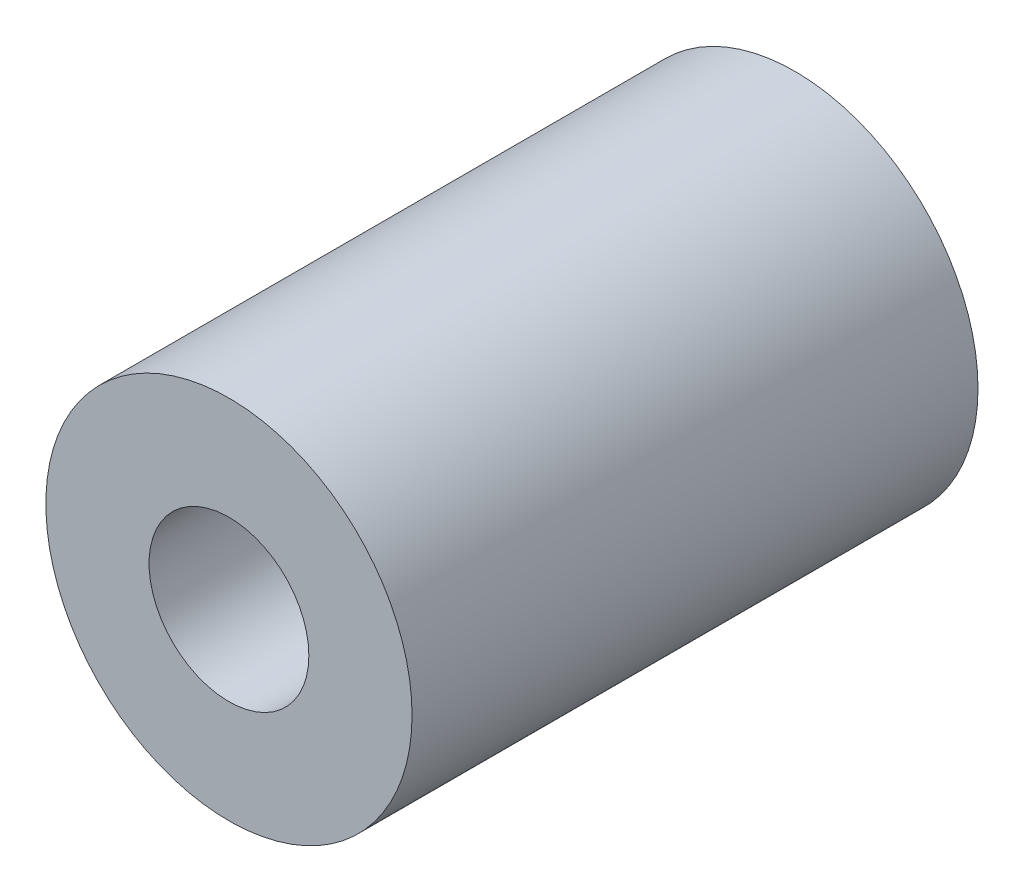
ISO-10303-21;
HEADER;
FILE_DESCRIPTION(('STEP AP214'),'2;1');
FILE_NAME('part.step','',(''),(''),'','','');
FILE_SCHEMA(('AUTOMOTIVE_DESIGN { 1 0 10303 214 1 1 1 1 }'));
ENDSEC;
DATA;
#1=APPLICATION_CONTEXT('core data for automotive mechanical design processes');
#2=APPLICATION_PROTOCOL_DEFINITION('international standard','automotive_design',2000,#1);
#3=PRODUCT_CONTEXT('',#1,'mechanical');
#4=PRODUCT('Part','Part','',(#3));
#5=PRODUCT_RELATED_PRODUCT_CATEGORY('part','',(#4));
#6=PRODUCT_DEFINITION_FORMATION('','',#4);
#7=PRODUCT_DEFINITION_CONTEXT('part definition',#1,'design');
#8=PRODUCT_DEFINITION('design','',#6,#7);
#9=PRODUCT_DEFINITION_SHAPE('','',#8);
#10=(LENGTH_UNIT() NAMED_UNIT(*) SI_UNIT(.MILLI.,.METRE.));
#11=(NAMED_UNIT(*) PLANE_ANGLE_UNIT() SI_UNIT($,.RADIAN.));
#12=(NAMED_UNIT(*) SI_UNIT($,.STERADIAN.) SOLID_ANGLE_UNIT());
#13=UNCERTAINTY_MEASURE_WITH_UNIT(LENGTH_MEASURE(1.E-05),#10,'distance_accuracy_value','');
#14=(GEOMETRIC_REPRESENTATION_CONTEXT(3) GLOBAL_UNCERTAINTY_ASSIGNED_CONTEXT((#13)) GLOBAL_UNIT_ASSIGNED_CONTEXT((#10,
#11,#12)) REPRESENTATION_CONTEXT('',''));
#15=CARTESIAN_POINT('',(0.,0.,0.));
#16=DIRECTION('',(0.,0.,1.));
#17=DIRECTION('',(1.,0.,0.));
#18=AXIS2_PLACEMENT_3D('',#15,#16,#17);
#19=CARTESIAN_POINT('',(0.,0.,85.));
#20=DIRECTION('',(0.,0.,1.));
#21=DIRECTION('',(1.,0.,0.));
#22=AXIS2_PLACEMENT_3D('',#19,#20,#21);
#23=PLANE('',#22);
#24=CARTESIAN_POINT('',(0.,0.,85.));
#25=DIRECTION('',(0.,0.,1.));
#26=DIRECTION('',(1.,0.,0.));
#27=AXIS2_PLACEMENT_3D('',#24,#25,#26);
#28=CIRCLE('',#27,27.5);
#29=CARTESIAN_POINT('',(27.5,0.,85.));
#30=VERTEX_POINT('',#29);
#31=EDGE_CURVE('E10',#30,#30,#28,.T.);
#32=ORIENTED_EDGE('',*,*,#31,.T.);
#33=EDGE_LOOP('',(#32));
#34=FACE_BOUND('',#33,.T.);
#35=CARTESIAN_POINT('',(0.,0.,85.));
#36=DIRECTION('',(0.,0.,1.));
#37=DIRECTION('',(1.,0.,0.));
#38=AXIS2_PLACEMENT_3D('',#35,#36,#37);
#39=CIRCLE('',#38,12.);
#40=CARTESIAN_POINT('',(12.,0.,85.));
#41=VERTEX_POINT('',#40);
#42=EDGE_CURVE('E44',#41,#41,#39,.T.);
#43=ORIENTED_EDGE('',*,*,#42,.F.);
#44=EDGE_LOOP('',(#43));
#45=FACE_BOUND('',#44,.T.);
#46=ADVANCED_FACE('F33',(#34,#45),#23,.T.);
#47=CARTESIAN_POINT('',(0.,0.,0.));
#48=DIRECTION('',(0.,0.,1.));
#49=DIRECTION('',(1.,0.,0.));
#50=AXIS2_PLACEMENT_3D('',#47,#48,#49);
#51=PLANE('',#50);
#52=CARTESIAN_POINT('',(0.,0.,0.));
#53=DIRECTION('',(0.,0.,1.));
#54=DIRECTION('',(1.,0.,0.));
#55=AXIS2_PLACEMENT_3D('',#52,#53,#54);
#56=CIRCLE('',#55,27.5);
#57=CARTESIAN_POINT('',(27.5,0.,0.));
#58=VERTEX_POINT('',#57);
#59=EDGE_CURVE('E37',#58,#58,#56,.T.);
#60=ORIENTED_EDGE('',*,*,#59,.F.);
#61=EDGE_LOOP('',(#60));
#62=FACE_BOUND('',#61,.T.);
#63=CARTESIAN_POINT('',(0.,0.,0.));
#64=DIRECTION('',(0.,0.,1.));
#65=DIRECTION('',(1.,0.,0.));
#66=AXIS2_PLACEMENT_3D('',#63,#64,#65);
#67=CIRCLE('',#66,12.);
#68=CARTESIAN_POINT('',(12.,0.,0.));
#69=VERTEX_POINT('',#68);
#70=EDGE_CURVE('E46',#69,#69,#67,.T.);
#71=ORIENTED_EDGE('',*,*,#70,.T.);
#72=EDGE_LOOP('',(#71));
#73=FACE_BOUND('',#72,.T.);
#74=ADVANCED_FACE('F56',(#62,#73),#51,.F.);
#75=CARTESIAN_POINT('',(0.,0.,85.));
#76=DIRECTION('',(0.,0.,-1.));
#77=DIRECTION('',(-1.,0.,0.));
#78=AXIS2_PLACEMENT_3D('',#75,#76,#77);
#79=CYLINDRICAL_SURFACE('',#78,27.5);
#80=ORIENTED_EDGE('',*,*,#31,.F.);
#81=EDGE_LOOP('',(#80));
#82=FACE_BOUND('',#81,.T.);
#83=ORIENTED_EDGE('',*,*,#59,.T.);
#84=EDGE_LOOP('',(#83));
#85=FACE_BOUND('',#84,.T.);
#86=ADVANCED_FACE('F35',(#82,#85),#79,.T.);
#87=CARTESIAN_POINT('',(0.,0.,85.));
#88=DIRECTION('',(0.,0.,-1.));
#89=DIRECTION('',(-1.,0.,0.));
#90=AXIS2_PLACEMENT_3D('',#87,#88,#89);
#91=CYLINDRICAL_SURFACE('',#90,12.);
#92=ORIENTED_EDGE('',*,*,#42,.T.);
#93=EDGE_LOOP('',(#92));
#94=FACE_BOUND('',#93,.T.);
#95=ORIENTED_EDGE('',*,*,#70,.F.);
#96=EDGE_LOOP('',(#95));
#97=FACE_BOUND('',#96,.T.);
#98=ADVANCED_FACE('F52',(#94,#97),#91,.F.);
#99=CLOSED_SHELL('',(#46,#74,#86,#98));
#100=MANIFOLD_SOLID_BREP('B2',#99);
#101=ADVANCED_BREP_SHAPE_REPRESENTATION('',(#18,#100),#14);
#102=SHAPE_DEFINITION_REPRESENTATION(#9,#101);
ENDSEC;
END-ISO-10303-21;
